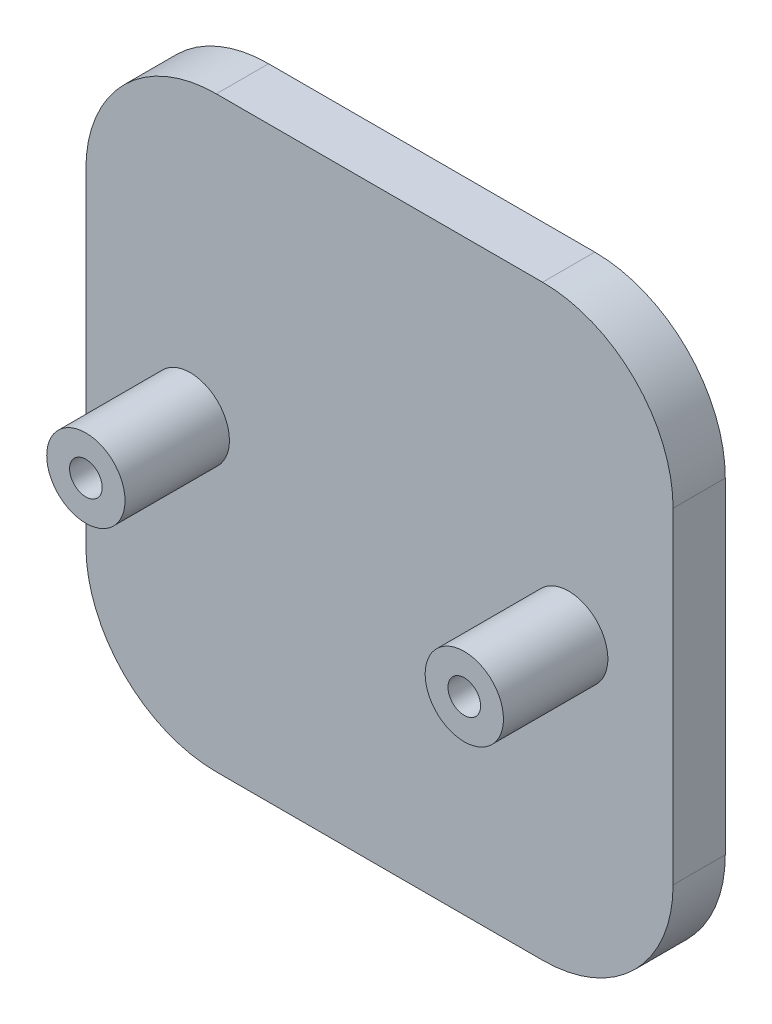
ISO-10303-21;
HEADER;
FILE_DESCRIPTION(('STEP AP214'),'2;1');
FILE_NAME('part.step','',(''),(''),'','','');
FILE_SCHEMA(('AUTOMOTIVE_DESIGN { 1 0 10303 214 1 1 1 1 }'));
ENDSEC;
DATA;
#1=APPLICATION_CONTEXT('core data for automotive mechanical design processes');
#2=APPLICATION_PROTOCOL_DEFINITION('international standard','automotive_design',2000,#1);
#3=PRODUCT_CONTEXT('',#1,'mechanical');
#4=PRODUCT('Part','Part','',(#3));
#5=PRODUCT_RELATED_PRODUCT_CATEGORY('part','',(#4));
#6=PRODUCT_DEFINITION_FORMATION('','',#4);
#7=PRODUCT_DEFINITION_CONTEXT('part definition',#1,'design');
#8=PRODUCT_DEFINITION('design','',#6,#7);
#9=PRODUCT_DEFINITION_SHAPE('','',#8);
#10=(LENGTH_UNIT() NAMED_UNIT(*) SI_UNIT(.MILLI.,.METRE.));
#11=(NAMED_UNIT(*) PLANE_ANGLE_UNIT() SI_UNIT($,.RADIAN.));
#12=(NAMED_UNIT(*) SI_UNIT($,.STERADIAN.) SOLID_ANGLE_UNIT());
#13=UNCERTAINTY_MEASURE_WITH_UNIT(LENGTH_MEASURE(1.E-05),#10,'distance_accuracy_value','');
#14=(GEOMETRIC_REPRESENTATION_CONTEXT(3) GLOBAL_UNCERTAINTY_ASSIGNED_CONTEXT((#13)) GLOBAL_UNIT_ASSIGNED_CONTEXT((#10,
#11,#12)) REPRESENTATION_CONTEXT('',''));
#15=CARTESIAN_POINT('',(0.,0.,0.));
#16=DIRECTION('',(0.,0.,1.));
#17=DIRECTION('',(1.,0.,0.));
#18=AXIS2_PLACEMENT_3D('',#15,#16,#17);
#19=CARTESIAN_POINT('',(22.5,-22.5,4.));
#20=DIRECTION('',(-1.,0.,0.));
#21=DIRECTION('',(0.,0.,1.));
#22=AXIS2_PLACEMENT_3D('',#19,#20,#21);
#23=PLANE('',#22);
#24=DIRECTION('',(0.,1.,0.));
#25=VECTOR('',#24,1.);
#26=CARTESIAN_POINT('',(22.5,-22.5,4.));
#27=LINE('',#26,#25);
#28=CARTESIAN_POINT('',(22.5,-12.5,4.));
#29=VERTEX_POINT('',#28);
#30=CARTESIAN_POINT('',(22.5,12.5,4.));
#31=VERTEX_POINT('',#30);
#32=EDGE_CURVE('E137',#29,#31,#27,.T.);
#33=ORIENTED_EDGE('',*,*,#32,.F.);
#34=DIRECTION('',(0.,0.,-1.));
#35=VECTOR('',#34,1.);
#36=CARTESIAN_POINT('',(22.5,-12.5,4.));
#37=LINE('',#36,#35);
#38=CARTESIAN_POINT('',(22.5,-12.5,0.));
#39=VERTEX_POINT('',#38);
#40=EDGE_CURVE('E46',#29,#39,#37,.T.);
#41=ORIENTED_EDGE('',*,*,#40,.T.);
#42=DIRECTION('',(0.,1.,0.));
#43=VECTOR('',#42,1.);
#44=CARTESIAN_POINT('',(22.5,-22.5,0.));
#45=LINE('',#44,#43);
#46=CARTESIAN_POINT('',(22.5,12.5,0.));
#47=VERTEX_POINT('',#46);
#48=EDGE_CURVE('E136',#39,#47,#45,.T.);
#49=ORIENTED_EDGE('',*,*,#48,.T.);
#50=DIRECTION('',(0.,0.,-1.));
#51=VECTOR('',#50,1.);
#52=CARTESIAN_POINT('',(22.5,12.5,4.));
#53=LINE('',#52,#51);
#54=EDGE_CURVE('E53',#47,#31,#53,.F.);
#55=ORIENTED_EDGE('',*,*,#54,.T.);
#56=EDGE_LOOP('',(#33,#41,#49,#55));
#57=FACE_BOUND('',#56,.T.);
#58=ADVANCED_FACE('F38',(#57),#23,.F.);
#59=CARTESIAN_POINT('',(-22.5,22.5,4.));
#60=DIRECTION('',(0.,-1.,0.));
#61=DIRECTION('',(0.,0.,-1.));
#62=AXIS2_PLACEMENT_3D('',#59,#60,#61);
#63=PLANE('',#62);
#64=DIRECTION('',(-1.,0.,0.));
#65=VECTOR('',#64,1.);
#66=CARTESIAN_POINT('',(-22.5,22.5,4.));
#67=LINE('',#66,#65);
#68=CARTESIAN_POINT('',(12.5,22.5,4.));
#69=VERTEX_POINT('',#68);
#70=CARTESIAN_POINT('',(-12.5,22.5,4.));
#71=VERTEX_POINT('',#70);
#72=EDGE_CURVE('E139',#69,#71,#67,.T.);
#73=ORIENTED_EDGE('',*,*,#72,.F.);
#74=DIRECTION('',(0.,0.,-1.));
#75=VECTOR('',#74,1.);
#76=CARTESIAN_POINT('',(12.5,22.5,4.));
#77=LINE('',#76,#75);
#78=CARTESIAN_POINT('',(12.5,22.5,0.));
#79=VERTEX_POINT('',#78);
#80=EDGE_CURVE('E11',#69,#79,#77,.T.);
#81=ORIENTED_EDGE('',*,*,#80,.T.);
#82=DIRECTION('',(-1.,0.,0.));
#83=VECTOR('',#82,1.);
#84=CARTESIAN_POINT('',(-22.5,22.5,0.));
#85=LINE('',#84,#83);
#86=CARTESIAN_POINT('',(-12.5,22.5,0.));
#87=VERTEX_POINT('',#86);
#88=EDGE_CURVE('E149',#79,#87,#85,.T.);
#89=ORIENTED_EDGE('',*,*,#88,.T.);
#90=DIRECTION('',(0.,0.,-1.));
#91=VECTOR('',#90,1.);
#92=CARTESIAN_POINT('',(-12.5,22.5,4.));
#93=LINE('',#92,#91);
#94=EDGE_CURVE('E167',#87,#71,#93,.F.);
#95=ORIENTED_EDGE('',*,*,#94,.T.);
#96=EDGE_LOOP('',(#73,#81,#89,#95));
#97=FACE_BOUND('',#96,.T.);
#98=ADVANCED_FACE('F203',(#97),#63,.F.);
#99=CARTESIAN_POINT('',(-22.5,-22.5,4.));
#100=DIRECTION('',(1.,0.,0.));
#101=DIRECTION('',(0.,0.,-1.));
#102=AXIS2_PLACEMENT_3D('',#99,#100,#101);
#103=PLANE('',#102);
#104=DIRECTION('',(0.,-1.,0.));
#105=VECTOR('',#104,1.);
#106=CARTESIAN_POINT('',(-22.5,-22.5,0.));
#107=LINE('',#106,#105);
#108=CARTESIAN_POINT('',(-22.5,12.5,0.));
#109=VERTEX_POINT('',#108);
#110=CARTESIAN_POINT('',(-22.5,-12.5,0.));
#111=VERTEX_POINT('',#110);
#112=EDGE_CURVE('E151',#109,#111,#107,.T.);
#113=ORIENTED_EDGE('',*,*,#112,.T.);
#114=DIRECTION('',(0.,0.,-1.));
#115=VECTOR('',#114,1.);
#116=CARTESIAN_POINT('',(-22.5,-12.5,4.));
#117=LINE('',#116,#115);
#118=CARTESIAN_POINT('',(-22.5,-12.5,4.));
#119=VERTEX_POINT('',#118);
#120=EDGE_CURVE('E183',#111,#119,#117,.F.);
#121=ORIENTED_EDGE('',*,*,#120,.T.);
#122=DIRECTION('',(0.,-1.,0.));
#123=VECTOR('',#122,1.);
#124=CARTESIAN_POINT('',(-22.5,-22.5,4.));
#125=LINE('',#124,#123);
#126=CARTESIAN_POINT('',(-22.5,12.5,4.));
#127=VERTEX_POINT('',#126);
#128=EDGE_CURVE('E142',#127,#119,#125,.T.);
#129=ORIENTED_EDGE('',*,*,#128,.F.);
#130=DIRECTION('',(0.,0.,-1.));
#131=VECTOR('',#130,1.);
#132=CARTESIAN_POINT('',(-22.5,12.5,4.));
#133=LINE('',#132,#131);
#134=EDGE_CURVE('E161',#127,#109,#133,.T.);
#135=ORIENTED_EDGE('',*,*,#134,.T.);
#136=EDGE_LOOP('',(#113,#121,#129,#135));
#137=FACE_BOUND('',#136,.T.);
#138=ADVANCED_FACE('F212',(#137),#103,.F.);
#139=CARTESIAN_POINT('',(-22.5,-22.5,4.));
#140=DIRECTION('',(0.,1.,0.));
#141=DIRECTION('',(0.,0.,1.));
#142=AXIS2_PLACEMENT_3D('',#139,#140,#141);
#143=PLANE('',#142);
#144=DIRECTION('',(1.,0.,0.));
#145=VECTOR('',#144,1.);
#146=CARTESIAN_POINT('',(-22.5,-22.5,4.));
#147=LINE('',#146,#145);
#148=CARTESIAN_POINT('',(-12.5,-22.5,4.));
#149=VERTEX_POINT('',#148);
#150=CARTESIAN_POINT('',(12.5,-22.5,4.));
#151=VERTEX_POINT('',#150);
#152=EDGE_CURVE('E145',#149,#151,#147,.T.);
#153=ORIENTED_EDGE('',*,*,#152,.F.);
#154=DIRECTION('',(0.,0.,-1.));
#155=VECTOR('',#154,1.);
#156=CARTESIAN_POINT('',(-12.5,-22.5,4.));
#157=LINE('',#156,#155);
#158=CARTESIAN_POINT('',(-12.5,-22.5,0.));
#159=VERTEX_POINT('',#158);
#160=EDGE_CURVE('E174',#149,#159,#157,.T.);
#161=ORIENTED_EDGE('',*,*,#160,.T.);
#162=DIRECTION('',(1.,0.,0.));
#163=VECTOR('',#162,1.);
#164=CARTESIAN_POINT('',(-22.5,-22.5,0.));
#165=LINE('',#164,#163);
#166=CARTESIAN_POINT('',(12.5,-22.5,0.));
#167=VERTEX_POINT('',#166);
#168=EDGE_CURVE('E140',#159,#167,#165,.T.);
#169=ORIENTED_EDGE('',*,*,#168,.T.);
#170=DIRECTION('',(0.,0.,-1.));
#171=VECTOR('',#170,1.);
#172=CARTESIAN_POINT('',(12.5,-22.5,4.));
#173=LINE('',#172,#171);
#174=EDGE_CURVE('E172',#167,#151,#173,.F.);
#175=ORIENTED_EDGE('',*,*,#174,.T.);
#176=EDGE_LOOP('',(#153,#161,#169,#175));
#177=FACE_BOUND('',#176,.T.);
#178=ADVANCED_FACE('F221',(#177),#143,.F.);
#179=CARTESIAN_POINT('',(0.,0.,4.));
#180=DIRECTION('',(0.,0.,-1.));
#181=DIRECTION('',(-1.,0.,0.));
#182=AXIS2_PLACEMENT_3D('',#179,#180,#181);
#183=PLANE('',#182);
#184=CARTESIAN_POINT('',(14.5,0.,4.));
#185=DIRECTION('',(0.,0.,-1.));
#186=DIRECTION('',(-1.,0.,0.));
#187=AXIS2_PLACEMENT_3D('',#184,#185,#186);
#188=CIRCLE('',#187,3.);
#189=CARTESIAN_POINT('',(11.5,0.,4.));
#190=VERTEX_POINT('',#189);
#191=EDGE_CURVE('E158',#190,#190,#188,.F.);
#192=ORIENTED_EDGE('',*,*,#191,.F.);
#193=EDGE_LOOP('',(#192));
#194=FACE_BOUND('',#193,.T.);
#195=CARTESIAN_POINT('',(-14.5,0.,4.));
#196=DIRECTION('',(0.,0.,-1.));
#197=DIRECTION('',(-1.,0.,0.));
#198=AXIS2_PLACEMENT_3D('',#195,#196,#197);
#199=CIRCLE('',#198,3.);
#200=CARTESIAN_POINT('',(-17.5,0.,4.));
#201=VERTEX_POINT('',#200);
#202=EDGE_CURVE('E147',#201,#201,#199,.F.);
#203=ORIENTED_EDGE('',*,*,#202,.F.);
#204=EDGE_LOOP('',(#203));
#205=FACE_BOUND('',#204,.T.);
#206=ORIENTED_EDGE('',*,*,#128,.T.);
#207=CARTESIAN_POINT('',(-12.5,-12.5,4.));
#208=DIRECTION('',(0.,0.,-1.));
#209=DIRECTION('',(-1.,0.,0.));
#210=AXIS2_PLACEMENT_3D('',#207,#208,#209);
#211=CIRCLE('',#210,10.);
#212=EDGE_CURVE('E188',#119,#149,#211,.F.);
#213=ORIENTED_EDGE('',*,*,#212,.T.);
#214=ORIENTED_EDGE('',*,*,#152,.T.);
#215=CARTESIAN_POINT('',(12.5,-12.5,4.));
#216=DIRECTION('',(0.,0.,-1.));
#217=DIRECTION('',(-1.,0.,0.));
#218=AXIS2_PLACEMENT_3D('',#215,#216,#217);
#219=CIRCLE('',#218,10.);
#220=EDGE_CURVE('E60',#151,#29,#219,.F.);
#221=ORIENTED_EDGE('',*,*,#220,.T.);
#222=ORIENTED_EDGE('',*,*,#32,.T.);
#223=CARTESIAN_POINT('',(12.5,12.5,4.));
#224=DIRECTION('',(0.,0.,-1.));
#225=DIRECTION('',(-1.,0.,0.));
#226=AXIS2_PLACEMENT_3D('',#223,#224,#225);
#227=CIRCLE('',#226,10.);
#228=EDGE_CURVE('E185',#31,#69,#227,.F.);
#229=ORIENTED_EDGE('',*,*,#228,.T.);
#230=ORIENTED_EDGE('',*,*,#72,.T.);
#231=CARTESIAN_POINT('',(-12.5,12.5,4.));
#232=DIRECTION('',(0.,0.,-1.));
#233=DIRECTION('',(-1.,0.,0.));
#234=AXIS2_PLACEMENT_3D('',#231,#232,#233);
#235=CIRCLE('',#234,10.);
#236=EDGE_CURVE('E170',#71,#127,#235,.F.);
#237=ORIENTED_EDGE('',*,*,#236,.T.);
#238=EDGE_LOOP('',(#206,#213,#214,#221,#222,#229,#230,#237));
#239=FACE_BOUND('',#238,.T.);
#240=ADVANCED_FACE('F206',(#194,#205,#239),#183,.F.);
#241=CARTESIAN_POINT('',(0.,0.,0.));
#242=DIRECTION('',(0.,0.,-1.));
#243=DIRECTION('',(-1.,0.,0.));
#244=AXIS2_PLACEMENT_3D('',#241,#242,#243);
#245=PLANE('',#244);
#246=ORIENTED_EDGE('',*,*,#168,.F.);
#247=CARTESIAN_POINT('',(-12.5,-12.5,0.));
#248=DIRECTION('',(0.,0.,-1.));
#249=DIRECTION('',(-1.,0.,0.));
#250=AXIS2_PLACEMENT_3D('',#247,#248,#249);
#251=CIRCLE('',#250,10.);
#252=EDGE_CURVE('E181',#159,#111,#251,.T.);
#253=ORIENTED_EDGE('',*,*,#252,.T.);
#254=ORIENTED_EDGE('',*,*,#112,.F.);
#255=CARTESIAN_POINT('',(-12.5,12.5,0.));
#256=DIRECTION('',(0.,0.,-1.));
#257=DIRECTION('',(-1.,0.,0.));
#258=AXIS2_PLACEMENT_3D('',#255,#256,#257);
#259=CIRCLE('',#258,10.);
#260=EDGE_CURVE('E164',#109,#87,#259,.T.);
#261=ORIENTED_EDGE('',*,*,#260,.T.);
#262=ORIENTED_EDGE('',*,*,#88,.F.);
#263=CARTESIAN_POINT('',(12.5,12.5,0.));
#264=DIRECTION('',(0.,0.,-1.));
#265=DIRECTION('',(-1.,0.,0.));
#266=AXIS2_PLACEMENT_3D('',#263,#264,#265);
#267=CIRCLE('',#266,10.);
#268=EDGE_CURVE('E177',#79,#47,#267,.T.);
#269=ORIENTED_EDGE('',*,*,#268,.T.);
#270=ORIENTED_EDGE('',*,*,#48,.F.);
#271=CARTESIAN_POINT('',(12.5,-12.5,0.));
#272=DIRECTION('',(0.,0.,-1.));
#273=DIRECTION('',(-1.,0.,0.));
#274=AXIS2_PLACEMENT_3D('',#271,#272,#273);
#275=CIRCLE('',#274,10.);
#276=EDGE_CURVE('E179',#39,#167,#275,.T.);
#277=ORIENTED_EDGE('',*,*,#276,.T.);
#278=EDGE_LOOP('',(#246,#253,#254,#261,#262,#269,#270,#277));
#279=FACE_BOUND('',#278,.T.);
#280=ADVANCED_FACE('F196',(#279),#245,.T.);
#281=CARTESIAN_POINT('',(-14.5,0.,12.));
#282=DIRECTION('',(0.,0.,-1.));
#283=DIRECTION('',(-1.,0.,0.));
#284=AXIS2_PLACEMENT_3D('',#281,#282,#283);
#285=CYLINDRICAL_SURFACE('',#284,3.);
#286=CARTESIAN_POINT('',(-14.5,0.,12.));
#287=DIRECTION('',(0.,0.,1.));
#288=DIRECTION('',(1.,0.,0.));
#289=AXIS2_PLACEMENT_3D('',#286,#287,#288);
#290=CIRCLE('',#289,3.);
#291=CARTESIAN_POINT('',(-11.5,0.,12.));
#292=VERTEX_POINT('',#291);
#293=EDGE_CURVE('E133',#292,#292,#290,.T.);
#294=ORIENTED_EDGE('',*,*,#293,.F.);
#295=EDGE_LOOP('',(#294));
#296=FACE_BOUND('',#295,.T.);
#297=ORIENTED_EDGE('',*,*,#202,.T.);
#298=EDGE_LOOP('',(#297));
#299=FACE_BOUND('',#298,.T.);
#300=ADVANCED_FACE('F265',(#296,#299),#285,.T.);
#301=CARTESIAN_POINT('',(-14.5,0.,12.));
#302=DIRECTION('',(0.,0.,1.));
#303=DIRECTION('',(1.,0.,0.));
#304=AXIS2_PLACEMENT_3D('',#301,#302,#303);
#305=PLANE('',#304);
#306=CARTESIAN_POINT('',(-14.5,0.,12.));
#307=DIRECTION('',(0.,0.,1.));
#308=DIRECTION('',(1.,0.,0.));
#309=AXIS2_PLACEMENT_3D('',#306,#307,#308);
#310=CIRCLE('',#309,1.24999999999999);
#311=CARTESIAN_POINT('',(-13.25,0.,12.));
#312=VERTEX_POINT('',#311);
#313=EDGE_CURVE('E119',#312,#312,#310,.T.);
#314=ORIENTED_EDGE('',*,*,#313,.F.);
#315=EDGE_LOOP('',(#314));
#316=FACE_BOUND('',#315,.T.);
#317=ORIENTED_EDGE('',*,*,#293,.T.);
#318=EDGE_LOOP('',(#317));
#319=FACE_BOUND('',#318,.T.);
#320=ADVANCED_FACE('F261',(#316,#319),#305,.T.);
#321=CARTESIAN_POINT('',(14.5,0.,12.));
#322=DIRECTION('',(0.,0.,-1.));
#323=DIRECTION('',(-1.,0.,0.));
#324=AXIS2_PLACEMENT_3D('',#321,#322,#323);
#325=CYLINDRICAL_SURFACE('',#324,3.);
#326=CARTESIAN_POINT('',(14.5,0.,12.));
#327=DIRECTION('',(0.,0.,1.));
#328=DIRECTION('',(1.,0.,0.));
#329=AXIS2_PLACEMENT_3D('',#326,#327,#328);
#330=CIRCLE('',#329,3.);
#331=CARTESIAN_POINT('',(17.5,0.,12.));
#332=VERTEX_POINT('',#331);
#333=EDGE_CURVE('E130',#332,#332,#330,.T.);
#334=ORIENTED_EDGE('',*,*,#333,.F.);
#335=EDGE_LOOP('',(#334));
#336=FACE_BOUND('',#335,.T.);
#337=ORIENTED_EDGE('',*,*,#191,.T.);
#338=EDGE_LOOP('',(#337));
#339=FACE_BOUND('',#338,.T.);
#340=ADVANCED_FACE('F257',(#336,#339),#325,.T.);
#341=CARTESIAN_POINT('',(14.5,0.,12.));
#342=DIRECTION('',(0.,0.,1.));
#343=DIRECTION('',(1.,0.,0.));
#344=AXIS2_PLACEMENT_3D('',#341,#342,#343);
#345=PLANE('',#344);
#346=CARTESIAN_POINT('',(14.5,0.,12.));
#347=DIRECTION('',(0.,0.,1.));
#348=DIRECTION('',(1.,0.,0.));
#349=AXIS2_PLACEMENT_3D('',#346,#347,#348);
#350=CIRCLE('',#349,1.24999999999999);
#351=CARTESIAN_POINT('',(15.75,0.,12.));
#352=VERTEX_POINT('',#351);
#353=EDGE_CURVE('E120',#352,#352,#350,.T.);
#354=ORIENTED_EDGE('',*,*,#353,.F.);
#355=EDGE_LOOP('',(#354));
#356=FACE_BOUND('',#355,.T.);
#357=ORIENTED_EDGE('',*,*,#333,.T.);
#358=EDGE_LOOP('',(#357));
#359=FACE_BOUND('',#358,.T.);
#360=ADVANCED_FACE('F253',(#356,#359),#345,.T.);
#361=CARTESIAN_POINT('',(-14.5,0.,3.99999999999999));
#362=DIRECTION('',(0.,0.,1.));
#363=DIRECTION('',(1.,0.,0.));
#364=AXIS2_PLACEMENT_3D('',#361,#362,#363);
#365=CONICAL_SURFACE('',#364,1.24999999999999,1.02974425867665);
#366=CARTESIAN_POINT('',(-14.5,0.,3.24892422621555));
#367=VERTEX_POINT('',#366);
#368=VERTEX_LOOP('',#367);
#369=FACE_BOUND('',#368,.T.);
#370=CARTESIAN_POINT('',(-14.5,0.,3.99999999999999));
#371=DIRECTION('',(0.,0.,1.));
#372=DIRECTION('',(1.,0.,0.));
#373=AXIS2_PLACEMENT_3D('',#370,#371,#372);
#374=CIRCLE('',#373,1.24999999999999);
#375=CARTESIAN_POINT('',(-13.25,0.,3.99999999999999));
#376=VERTEX_POINT('',#375);
#377=EDGE_CURVE('E123',#376,#376,#374,.T.);
#378=ORIENTED_EDGE('',*,*,#377,.T.);
#379=EDGE_LOOP('',(#378));
#380=FACE_BOUND('',#379,.T.);
#381=ADVANCED_FACE('F249',(#369,#380),#365,.F.);
#382=CARTESIAN_POINT('',(-14.5,0.,12.));
#383=DIRECTION('',(0.,0.,1.));
#384=DIRECTION('',(1.,0.,0.));
#385=AXIS2_PLACEMENT_3D('',#382,#383,#384);
#386=CYLINDRICAL_SURFACE('',#385,1.24999999999999);
#387=ORIENTED_EDGE('',*,*,#377,.F.);
#388=EDGE_LOOP('',(#387));
#389=FACE_BOUND('',#388,.T.);
#390=ORIENTED_EDGE('',*,*,#313,.T.);
#391=EDGE_LOOP('',(#390));
#392=FACE_BOUND('',#391,.T.);
#393=ADVANCED_FACE('F113',(#389,#392),#386,.F.);
#394=CARTESIAN_POINT('',(14.5,0.,3.99999999999999));
#395=DIRECTION('',(0.,0.,1.));
#396=DIRECTION('',(1.,0.,0.));
#397=AXIS2_PLACEMENT_3D('',#394,#395,#396);
#398=CONICAL_SURFACE('',#397,1.24999999999999,1.02974425867665);
#399=CARTESIAN_POINT('',(14.5,0.,3.24892422621555));
#400=VERTEX_POINT('',#399);
#401=VERTEX_LOOP('',#400);
#402=FACE_BOUND('',#401,.T.);
#403=CARTESIAN_POINT('',(14.5,0.,3.99999999999999));
#404=DIRECTION('',(0.,0.,1.));
#405=DIRECTION('',(1.,0.,0.));
#406=AXIS2_PLACEMENT_3D('',#403,#404,#405);
#407=CIRCLE('',#406,1.24999999999999);
#408=CARTESIAN_POINT('',(15.75,0.,3.99999999999999));
#409=VERTEX_POINT('',#408);
#410=EDGE_CURVE('E117',#409,#409,#407,.T.);
#411=ORIENTED_EDGE('',*,*,#410,.T.);
#412=EDGE_LOOP('',(#411));
#413=FACE_BOUND('',#412,.T.);
#414=ADVANCED_FACE('F109',(#402,#413),#398,.F.);
#415=CARTESIAN_POINT('',(14.5,0.,12.));
#416=DIRECTION('',(0.,0.,1.));
#417=DIRECTION('',(1.,0.,0.));
#418=AXIS2_PLACEMENT_3D('',#415,#416,#417);
#419=CYLINDRICAL_SURFACE('',#418,1.24999999999999);
#420=ORIENTED_EDGE('',*,*,#410,.F.);
#421=EDGE_LOOP('',(#420));
#422=FACE_BOUND('',#421,.T.);
#423=ORIENTED_EDGE('',*,*,#353,.T.);
#424=EDGE_LOOP('',(#423));
#425=FACE_BOUND('',#424,.T.);
#426=ADVANCED_FACE('F112',(#422,#425),#419,.F.);
#427=CARTESIAN_POINT('',(-12.5,12.5,4.));
#428=DIRECTION('',(0.,0.,-1.));
#429=DIRECTION('',(-1.,0.,0.));
#430=AXIS2_PLACEMENT_3D('',#427,#428,#429);
#431=CYLINDRICAL_SURFACE('',#430,10.);
#432=ORIENTED_EDGE('',*,*,#236,.F.);
#433=ORIENTED_EDGE('',*,*,#94,.F.);
#434=ORIENTED_EDGE('',*,*,#260,.F.);
#435=ORIENTED_EDGE('',*,*,#134,.F.);
#436=EDGE_LOOP('',(#432,#433,#434,#435));
#437=FACE_BOUND('',#436,.T.);
#438=ADVANCED_FACE('F215',(#437),#431,.T.);
#439=CARTESIAN_POINT('',(-12.5,-12.5,4.));
#440=DIRECTION('',(0.,0.,-1.));
#441=DIRECTION('',(-1.,0.,0.));
#442=AXIS2_PLACEMENT_3D('',#439,#440,#441);
#443=CYLINDRICAL_SURFACE('',#442,10.);
#444=ORIENTED_EDGE('',*,*,#212,.F.);
#445=ORIENTED_EDGE('',*,*,#120,.F.);
#446=ORIENTED_EDGE('',*,*,#252,.F.);
#447=ORIENTED_EDGE('',*,*,#160,.F.);
#448=EDGE_LOOP('',(#444,#445,#446,#447));
#449=FACE_BOUND('',#448,.T.);
#450=ADVANCED_FACE('F217',(#449),#443,.T.);
#451=CARTESIAN_POINT('',(12.5,-12.5,4.));
#452=DIRECTION('',(0.,0.,-1.));
#453=DIRECTION('',(-1.,0.,0.));
#454=AXIS2_PLACEMENT_3D('',#451,#452,#453);
#455=CYLINDRICAL_SURFACE('',#454,10.);
#456=ORIENTED_EDGE('',*,*,#220,.F.);
#457=ORIENTED_EDGE('',*,*,#174,.F.);
#458=ORIENTED_EDGE('',*,*,#276,.F.);
#459=ORIENTED_EDGE('',*,*,#40,.F.);
#460=EDGE_LOOP('',(#456,#457,#458,#459));
#461=FACE_BOUND('',#460,.T.);
#462=ADVANCED_FACE('F223',(#461),#455,.T.);
#463=CARTESIAN_POINT('',(12.5,12.5,4.));
#464=DIRECTION('',(0.,0.,-1.));
#465=DIRECTION('',(-1.,0.,0.));
#466=AXIS2_PLACEMENT_3D('',#463,#464,#465);
#467=CYLINDRICAL_SURFACE('',#466,10.);
#468=ORIENTED_EDGE('',*,*,#228,.F.);
#469=ORIENTED_EDGE('',*,*,#54,.F.);
#470=ORIENTED_EDGE('',*,*,#268,.F.);
#471=ORIENTED_EDGE('',*,*,#80,.F.);
#472=EDGE_LOOP('',(#468,#469,#470,#471));
#473=FACE_BOUND('',#472,.T.);
#474=ADVANCED_FACE('F40',(#473),#467,.T.);
#475=CLOSED_SHELL('',(#58,#98,#138,#178,#240,#280,#300,#320,#340,#360,#381,#393,#414,#426,#438,
#450,#462,#474));
#476=MANIFOLD_SOLID_BREP('B2',#475);
#477=ADVANCED_BREP_SHAPE_REPRESENTATION('',(#18,#476),#14);
#478=SHAPE_DEFINITION_REPRESENTATION(#9,#477);
ENDSEC;
END-ISO-10303-21;
